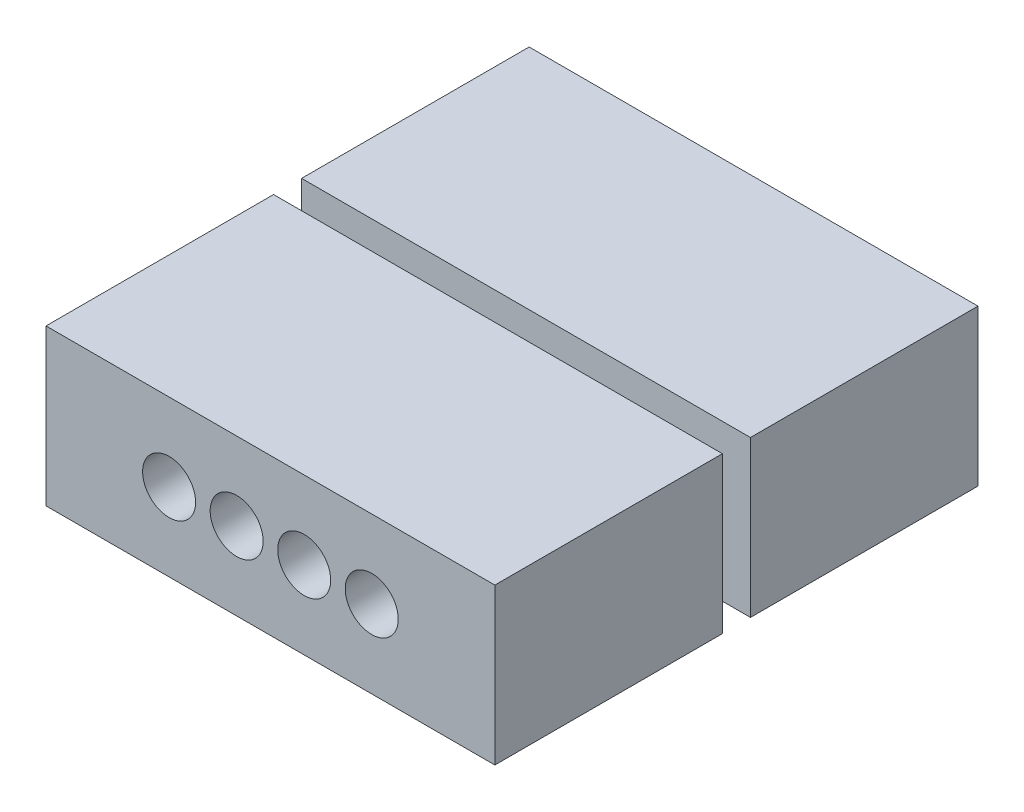
ISO-10303-21;
HEADER;
FILE_DESCRIPTION(('STEP AP214'),'2;1');
FILE_NAME('part.step','',(''),(''),'','','');
FILE_SCHEMA(('AUTOMOTIVE_DESIGN { 1 0 10303 214 1 1 1 1 }'));
ENDSEC;
DATA;
#1=APPLICATION_CONTEXT('core data for automotive mechanical design processes');
#2=APPLICATION_PROTOCOL_DEFINITION('international standard','automotive_design',2000,#1);
#3=PRODUCT_CONTEXT('',#1,'mechanical');
#4=PRODUCT('Part','Part','',(#3));
#5=PRODUCT_RELATED_PRODUCT_CATEGORY('part','',(#4));
#6=PRODUCT_DEFINITION_FORMATION('','',#4);
#7=PRODUCT_DEFINITION_CONTEXT('part definition',#1,'design');
#8=PRODUCT_DEFINITION('design','',#6,#7);
#9=PRODUCT_DEFINITION_SHAPE('','',#8);
#10=(LENGTH_UNIT() NAMED_UNIT(*) SI_UNIT(.MILLI.,.METRE.));
#11=(NAMED_UNIT(*) PLANE_ANGLE_UNIT() SI_UNIT($,.RADIAN.));
#12=(NAMED_UNIT(*) SI_UNIT($,.STERADIAN.) SOLID_ANGLE_UNIT());
#13=UNCERTAINTY_MEASURE_WITH_UNIT(LENGTH_MEASURE(1.E-05),#10,'distance_accuracy_value','');
#14=(GEOMETRIC_REPRESENTATION_CONTEXT(3) GLOBAL_UNCERTAINTY_ASSIGNED_CONTEXT((#13)) GLOBAL_UNIT_ASSIGNED_CONTEXT((#10,
#11,#12)) REPRESENTATION_CONTEXT('',''));
#15=CARTESIAN_POINT('',(0.,0.,0.));
#16=DIRECTION('',(0.,0.,1.));
#17=DIRECTION('',(1.,0.,0.));
#18=AXIS2_PLACEMENT_3D('',#15,#16,#17);
#19=CARTESIAN_POINT('',(0.,5.,0.));
#20=DIRECTION('',(0.,-1.,0.));
#21=DIRECTION('',(0.,0.,-1.));
#22=AXIS2_PLACEMENT_3D('',#19,#20,#21);
#23=PLANE('',#22);
#24=DIRECTION('',(1.,0.,0.));
#25=VECTOR('',#24,1.);
#26=CARTESIAN_POINT('',(-7.2,5.,-0.450000000000001));
#27=LINE('',#26,#25);
#28=CARTESIAN_POINT('',(-7.2,5.,-0.450000000000001));
#29=VERTEX_POINT('',#28);
#30=CARTESIAN_POINT('',(7.2,5.,-0.450000000000001));
#31=VERTEX_POINT('',#30);
#32=EDGE_CURVE('E58',#29,#31,#27,.T.);
#33=ORIENTED_EDGE('',*,*,#32,.T.);
#34=DIRECTION('',(0.,0.,-1.));
#35=VECTOR('',#34,1.);
#36=CARTESIAN_POINT('',(7.2,5.,-0.450000000000001));
#37=LINE('',#36,#35);
#38=CARTESIAN_POINT('',(7.2,5.,-7.75));
#39=VERTEX_POINT('',#38);
#40=EDGE_CURVE('E184',#31,#39,#37,.T.);
#41=ORIENTED_EDGE('',*,*,#40,.T.);
#42=DIRECTION('',(-1.,0.,0.));
#43=VECTOR('',#42,1.);
#44=CARTESIAN_POINT('',(-7.2,5.,-7.75));
#45=LINE('',#44,#43);
#46=CARTESIAN_POINT('',(-7.2,5.,-7.75));
#47=VERTEX_POINT('',#46);
#48=EDGE_CURVE('E111',#39,#47,#45,.T.);
#49=ORIENTED_EDGE('',*,*,#48,.T.);
#50=DIRECTION('',(0.,0.,1.));
#51=VECTOR('',#50,1.);
#52=CARTESIAN_POINT('',(-7.2,5.,-0.450000000000001));
#53=LINE('',#52,#51);
#54=EDGE_CURVE('E206',#47,#29,#53,.T.);
#55=ORIENTED_EDGE('',*,*,#54,.T.);
#56=EDGE_LOOP('',(#33,#41,#49,#55));
#57=FACE_BOUND('',#56,.T.);
#58=ADVANCED_FACE('F34',(#57),#23,.F.);
#59=CARTESIAN_POINT('',(7.2,5.,-0.450000000000001));
#60=DIRECTION('',(-1.,0.,0.));
#61=DIRECTION('',(0.,0.,1.));
#62=AXIS2_PLACEMENT_3D('',#59,#60,#61);
#63=PLANE('',#62);
#64=DIRECTION('',(0.,0.,-1.));
#65=VECTOR('',#64,1.);
#66=CARTESIAN_POINT('',(7.2,0.,-0.450000000000001));
#67=LINE('',#66,#65);
#68=CARTESIAN_POINT('',(7.2,0.,-0.450000000000001));
#69=VERTEX_POINT('',#68);
#70=CARTESIAN_POINT('',(7.2,0.,-7.75));
#71=VERTEX_POINT('',#70);
#72=EDGE_CURVE('E157',#69,#71,#67,.T.);
#73=ORIENTED_EDGE('',*,*,#72,.T.);
#74=DIRECTION('',(0.,-1.,0.));
#75=VECTOR('',#74,1.);
#76=CARTESIAN_POINT('',(7.2,5.,-7.75));
#77=LINE('',#76,#75);
#78=EDGE_CURVE('E11',#39,#71,#77,.T.);
#79=ORIENTED_EDGE('',*,*,#78,.F.);
#80=ORIENTED_EDGE('',*,*,#40,.F.);
#81=DIRECTION('',(0.,-1.,0.));
#82=VECTOR('',#81,1.);
#83=CARTESIAN_POINT('',(7.2,5.,-0.450000000000001));
#84=LINE('',#83,#82);
#85=EDGE_CURVE('E151',#31,#69,#84,.T.);
#86=ORIENTED_EDGE('',*,*,#85,.T.);
#87=EDGE_LOOP('',(#73,#79,#80,#86));
#88=FACE_BOUND('',#87,.T.);
#89=ADVANCED_FACE('F36',(#88),#63,.F.);
#90=CARTESIAN_POINT('',(-7.2,5.,-7.75));
#91=DIRECTION('',(0.,0.,1.));
#92=DIRECTION('',(1.,0.,0.));
#93=AXIS2_PLACEMENT_3D('',#90,#91,#92);
#94=PLANE('',#93);
#95=DIRECTION('',(-1.,0.,0.));
#96=VECTOR('',#95,1.);
#97=CARTESIAN_POINT('',(4.7,2.,-7.75));
#98=LINE('',#97,#96);
#99=CARTESIAN_POINT('',(4.7,2.,-7.75));
#100=VERTEX_POINT('',#99);
#101=CARTESIAN_POINT('',(-4.7,2.,-7.75));
#102=VERTEX_POINT('',#101);
#103=EDGE_CURVE('E277',#100,#102,#98,.T.);
#104=ORIENTED_EDGE('',*,*,#103,.F.);
#105=DIRECTION('',(0.,-1.,0.));
#106=VECTOR('',#105,1.);
#107=CARTESIAN_POINT('',(4.7,3.2,-7.75));
#108=LINE('',#107,#106);
#109=CARTESIAN_POINT('',(4.7,3.2,-7.75));
#110=VERTEX_POINT('',#109);
#111=EDGE_CURVE('E49',#110,#100,#108,.T.);
#112=ORIENTED_EDGE('',*,*,#111,.F.);
#113=DIRECTION('',(-1.,0.,0.));
#114=VECTOR('',#113,1.);
#115=CARTESIAN_POINT('',(4.7,3.2,-7.75));
#116=LINE('',#115,#114);
#117=CARTESIAN_POINT('',(-4.7,3.2,-7.75));
#118=VERTEX_POINT('',#117);
#119=EDGE_CURVE('E270',#110,#118,#116,.T.);
#120=ORIENTED_EDGE('',*,*,#119,.T.);
#121=DIRECTION('',(0.,-1.,0.));
#122=VECTOR('',#121,1.);
#123=CARTESIAN_POINT('',(-4.7,3.2,-7.75));
#124=LINE('',#123,#122);
#125=EDGE_CURVE('E274',#118,#102,#124,.T.);
#126=ORIENTED_EDGE('',*,*,#125,.T.);
#127=EDGE_LOOP('',(#104,#112,#120,#126));
#128=FACE_BOUND('',#127,.T.);
#129=DIRECTION('',(-1.,0.,0.));
#130=VECTOR('',#129,1.);
#131=CARTESIAN_POINT('',(-7.2,0.,-7.75));
#132=LINE('',#131,#130);
#133=CARTESIAN_POINT('',(-7.2,0.,-7.75));
#134=VERTEX_POINT('',#133);
#135=EDGE_CURVE('E160',#71,#134,#132,.T.);
#136=ORIENTED_EDGE('',*,*,#135,.T.);
#137=DIRECTION('',(0.,-1.,0.));
#138=VECTOR('',#137,1.);
#139=CARTESIAN_POINT('',(-7.2,5.,-7.75));
#140=LINE('',#139,#138);
#141=EDGE_CURVE('E42',#47,#134,#140,.T.);
#142=ORIENTED_EDGE('',*,*,#141,.F.);
#143=ORIENTED_EDGE('',*,*,#48,.F.);
#144=ORIENTED_EDGE('',*,*,#78,.T.);
#145=EDGE_LOOP('',(#136,#142,#143,#144));
#146=FACE_BOUND('',#145,.T.);
#147=ADVANCED_FACE('F343',(#128,#146),#94,.F.);
#148=CARTESIAN_POINT('',(-7.2,5.,-0.450000000000001));
#149=DIRECTION('',(1.,0.,0.));
#150=DIRECTION('',(0.,0.,-1.));
#151=AXIS2_PLACEMENT_3D('',#148,#149,#150);
#152=PLANE('',#151);
#153=DIRECTION('',(0.,0.,1.));
#154=VECTOR('',#153,1.);
#155=CARTESIAN_POINT('',(-7.2,0.,-0.450000000000001));
#156=LINE('',#155,#154);
#157=CARTESIAN_POINT('',(-7.2,0.,-0.450000000000001));
#158=VERTEX_POINT('',#157);
#159=EDGE_CURVE('E163',#134,#158,#156,.T.);
#160=ORIENTED_EDGE('',*,*,#159,.T.);
#161=DIRECTION('',(0.,-1.,0.));
#162=VECTOR('',#161,1.);
#163=CARTESIAN_POINT('',(-7.2,5.,-0.450000000000001));
#164=LINE('',#163,#162);
#165=EDGE_CURVE('E198',#29,#158,#164,.T.);
#166=ORIENTED_EDGE('',*,*,#165,.F.);
#167=ORIENTED_EDGE('',*,*,#54,.F.);
#168=ORIENTED_EDGE('',*,*,#141,.T.);
#169=EDGE_LOOP('',(#160,#166,#167,#168));
#170=FACE_BOUND('',#169,.T.);
#171=ADVANCED_FACE('F204',(#170),#152,.F.);
#172=CARTESIAN_POINT('',(-6.2,5.,-0.450000000000001));
#173=DIRECTION('',(1.,0.,0.));
#174=DIRECTION('',(0.,0.,-1.));
#175=AXIS2_PLACEMENT_3D('',#172,#173,#174);
#176=PLANE('',#175);
#177=DIRECTION('',(0.,-1.,0.));
#178=VECTOR('',#177,1.);
#179=CARTESIAN_POINT('',(-6.2,5.,0.449999999999999));
#180=LINE('',#179,#178);
#181=CARTESIAN_POINT('',(-6.2,3.5,0.449999999999999));
#182=VERTEX_POINT('',#181);
#183=CARTESIAN_POINT('',(-6.2,0.,0.449999999999999));
#184=VERTEX_POINT('',#183);
#185=EDGE_CURVE('E194',#182,#184,#180,.T.);
#186=ORIENTED_EDGE('',*,*,#185,.F.);
#187=DIRECTION('',(0.,0.,1.));
#188=VECTOR('',#187,1.);
#189=CARTESIAN_POINT('',(-6.2,3.5,0.449999999999999));
#190=LINE('',#189,#188);
#191=CARTESIAN_POINT('',(-6.2,3.5,-0.450000000000001));
#192=VERTEX_POINT('',#191);
#193=EDGE_CURVE('E232',#192,#182,#190,.T.);
#194=ORIENTED_EDGE('',*,*,#193,.F.);
#195=DIRECTION('',(0.,-1.,0.));
#196=VECTOR('',#195,1.);
#197=CARTESIAN_POINT('',(-6.2,5.,-0.450000000000001));
#198=LINE('',#197,#196);
#199=CARTESIAN_POINT('',(-6.2,0.,-0.450000000000001));
#200=VERTEX_POINT('',#199);
#201=EDGE_CURVE('E196',#192,#200,#198,.T.);
#202=ORIENTED_EDGE('',*,*,#201,.T.);
#203=DIRECTION('',(0.,0.,1.));
#204=VECTOR('',#203,1.);
#205=CARTESIAN_POINT('',(-6.2,0.,-0.450000000000001));
#206=LINE('',#205,#204);
#207=EDGE_CURVE('E168',#200,#184,#206,.T.);
#208=ORIENTED_EDGE('',*,*,#207,.T.);
#209=EDGE_LOOP('',(#186,#194,#202,#208));
#210=FACE_BOUND('',#209,.T.);
#211=ADVANCED_FACE('F327',(#210),#176,.F.);
#212=CARTESIAN_POINT('',(-7.2,5.,7.75));
#213=DIRECTION('',(1.,0.,0.));
#214=DIRECTION('',(0.,0.,-1.));
#215=AXIS2_PLACEMENT_3D('',#212,#213,#214);
#216=PLANE('',#215);
#217=DIRECTION('',(0.,0.,1.));
#218=VECTOR('',#217,1.);
#219=CARTESIAN_POINT('',(-7.2,0.,7.75));
#220=LINE('',#219,#218);
#221=CARTESIAN_POINT('',(-7.2,0.,0.449999999999999));
#222=VERTEX_POINT('',#221);
#223=CARTESIAN_POINT('',(-7.2,0.,7.75));
#224=VERTEX_POINT('',#223);
#225=EDGE_CURVE('E173',#222,#224,#220,.T.);
#226=ORIENTED_EDGE('',*,*,#225,.T.);
#227=DIRECTION('',(0.,-1.,0.));
#228=VECTOR('',#227,1.);
#229=CARTESIAN_POINT('',(-7.2,5.,7.75));
#230=LINE('',#229,#228);
#231=CARTESIAN_POINT('',(-7.2,5.,7.75));
#232=VERTEX_POINT('',#231);
#233=EDGE_CURVE('E146',#232,#224,#230,.T.);
#234=ORIENTED_EDGE('',*,*,#233,.F.);
#235=DIRECTION('',(0.,0.,1.));
#236=VECTOR('',#235,1.);
#237=CARTESIAN_POINT('',(-7.2,5.,7.75));
#238=LINE('',#237,#236);
#239=CARTESIAN_POINT('',(-7.2,5.,0.449999999999999));
#240=VERTEX_POINT('',#239);
#241=EDGE_CURVE('E134',#240,#232,#238,.T.);
#242=ORIENTED_EDGE('',*,*,#241,.F.);
#243=DIRECTION('',(0.,-1.,0.));
#244=VECTOR('',#243,1.);
#245=CARTESIAN_POINT('',(-7.2,5.,0.449999999999999));
#246=LINE('',#245,#244);
#247=EDGE_CURVE('E191',#240,#222,#246,.T.);
#248=ORIENTED_EDGE('',*,*,#247,.T.);
#249=EDGE_LOOP('',(#226,#234,#242,#248));
#250=FACE_BOUND('',#249,.T.);
#251=ADVANCED_FACE('F363',(#250),#216,.F.);
#252=CARTESIAN_POINT('',(-7.2,5.,7.75));
#253=DIRECTION('',(0.,0.,-1.));
#254=DIRECTION('',(-1.,0.,0.));
#255=AXIS2_PLACEMENT_3D('',#252,#253,#254);
#256=PLANE('',#255);
#257=CARTESIAN_POINT('',(3.25,2.5,7.75));
#258=DIRECTION('',(0.,0.,1.));
#259=DIRECTION('',(1.,0.,0.));
#260=AXIS2_PLACEMENT_3D('',#257,#258,#259);
#261=CIRCLE('',#260,0.849999999999999);
#262=CARTESIAN_POINT('',(4.1,2.5,7.75));
#263=VERTEX_POINT('',#262);
#264=EDGE_CURVE('E254',#263,#263,#261,.T.);
#265=ORIENTED_EDGE('',*,*,#264,.F.);
#266=EDGE_LOOP('',(#265));
#267=FACE_BOUND('',#266,.T.);
#268=CARTESIAN_POINT('',(1.08333333333333,2.5,7.75));
#269=DIRECTION('',(0.,0.,1.));
#270=DIRECTION('',(1.,0.,0.));
#271=AXIS2_PLACEMENT_3D('',#268,#269,#270);
#272=CIRCLE('',#271,0.85);
#273=CARTESIAN_POINT('',(1.93333333333333,2.5,7.75));
#274=VERTEX_POINT('',#273);
#275=EDGE_CURVE('E248',#274,#274,#272,.T.);
#276=ORIENTED_EDGE('',*,*,#275,.F.);
#277=EDGE_LOOP('',(#276));
#278=FACE_BOUND('',#277,.T.);
#279=CARTESIAN_POINT('',(-3.25,2.5,7.75));
#280=DIRECTION('',(0.,0.,1.));
#281=DIRECTION('',(1.,0.,0.));
#282=AXIS2_PLACEMENT_3D('',#279,#280,#281);
#283=CIRCLE('',#282,0.85);
#284=CARTESIAN_POINT('',(-2.4,2.5,7.75));
#285=VERTEX_POINT('',#284);
#286=EDGE_CURVE('E242',#285,#285,#283,.T.);
#287=ORIENTED_EDGE('',*,*,#286,.F.);
#288=EDGE_LOOP('',(#287));
#289=FACE_BOUND('',#288,.T.);
#290=CARTESIAN_POINT('',(-1.08333333333333,2.5,7.75));
#291=DIRECTION('',(0.,0.,1.));
#292=DIRECTION('',(1.,0.,0.));
#293=AXIS2_PLACEMENT_3D('',#290,#291,#292);
#294=CIRCLE('',#293,0.85);
#295=CARTESIAN_POINT('',(-0.233333333333333,2.5,7.75));
#296=VERTEX_POINT('',#295);
#297=EDGE_CURVE('E236',#296,#296,#294,.T.);
#298=ORIENTED_EDGE('',*,*,#297,.F.);
#299=EDGE_LOOP('',(#298));
#300=FACE_BOUND('',#299,.T.);
#301=DIRECTION('',(1.,0.,0.));
#302=VECTOR('',#301,1.);
#303=CARTESIAN_POINT('',(-7.2,0.,7.75));
#304=LINE('',#303,#302);
#305=CARTESIAN_POINT('',(7.2,0.,7.75));
#306=VERTEX_POINT('',#305);
#307=EDGE_CURVE('E143',#224,#306,#304,.T.);
#308=ORIENTED_EDGE('',*,*,#307,.T.);
#309=DIRECTION('',(0.,-1.,0.));
#310=VECTOR('',#309,1.);
#311=CARTESIAN_POINT('',(7.2,5.,7.75));
#312=LINE('',#311,#310);
#313=CARTESIAN_POINT('',(7.2,5.,7.75));
#314=VERTEX_POINT('',#313);
#315=EDGE_CURVE('E140',#314,#306,#312,.T.);
#316=ORIENTED_EDGE('',*,*,#315,.F.);
#317=DIRECTION('',(1.,0.,0.));
#318=VECTOR('',#317,1.);
#319=CARTESIAN_POINT('',(-7.2,5.,7.75));
#320=LINE('',#319,#318);
#321=EDGE_CURVE('E127',#232,#314,#320,.T.);
#322=ORIENTED_EDGE('',*,*,#321,.F.);
#323=ORIENTED_EDGE('',*,*,#233,.T.);
#324=EDGE_LOOP('',(#308,#316,#322,#323));
#325=FACE_BOUND('',#324,.T.);
#326=ADVANCED_FACE('F141',(#267,#278,#289,#300,#325),#256,.F.);
#327=CARTESIAN_POINT('',(7.2,5.,7.75));
#328=DIRECTION('',(-1.,0.,0.));
#329=DIRECTION('',(0.,0.,1.));
#330=AXIS2_PLACEMENT_3D('',#327,#328,#329);
#331=PLANE('',#330);
#332=DIRECTION('',(0.,0.,-1.));
#333=VECTOR('',#332,1.);
#334=CARTESIAN_POINT('',(7.2,0.,7.75));
#335=LINE('',#334,#333);
#336=CARTESIAN_POINT('',(7.2,0.,0.449999999999999));
#337=VERTEX_POINT('',#336);
#338=EDGE_CURVE('E176',#306,#337,#335,.T.);
#339=ORIENTED_EDGE('',*,*,#338,.T.);
#340=DIRECTION('',(0.,-1.,0.));
#341=VECTOR('',#340,1.);
#342=CARTESIAN_POINT('',(7.2,5.,0.449999999999999));
#343=LINE('',#342,#341);
#344=CARTESIAN_POINT('',(7.2,5.,0.449999999999999));
#345=VERTEX_POINT('',#344);
#346=EDGE_CURVE('E147',#345,#337,#343,.T.);
#347=ORIENTED_EDGE('',*,*,#346,.F.);
#348=DIRECTION('',(0.,0.,-1.));
#349=VECTOR('',#348,1.);
#350=CARTESIAN_POINT('',(7.2,5.,7.75));
#351=LINE('',#350,#349);
#352=EDGE_CURVE('E131',#314,#345,#351,.T.);
#353=ORIENTED_EDGE('',*,*,#352,.F.);
#354=ORIENTED_EDGE('',*,*,#315,.T.);
#355=EDGE_LOOP('',(#339,#347,#353,#354));
#356=FACE_BOUND('',#355,.T.);
#357=ADVANCED_FACE('F149',(#356),#331,.F.);
#358=CARTESIAN_POINT('',(7.2,5.,0.449999999999999));
#359=DIRECTION('',(0.,0.,1.));
#360=DIRECTION('',(1.,0.,0.));
#361=AXIS2_PLACEMENT_3D('',#358,#359,#360);
#362=PLANE('',#361);
#363=DIRECTION('',(-1.,0.,0.));
#364=VECTOR('',#363,1.);
#365=CARTESIAN_POINT('',(7.2,0.,0.449999999999999));
#366=LINE('',#365,#364);
#367=CARTESIAN_POINT('',(6.2,0.,0.449999999999999));
#368=VERTEX_POINT('',#367);
#369=EDGE_CURVE('E178',#337,#368,#366,.T.);
#370=ORIENTED_EDGE('',*,*,#369,.T.);
#371=DIRECTION('',(0.,-1.,0.));
#372=VECTOR('',#371,1.);
#373=CARTESIAN_POINT('',(6.2,5.,0.449999999999999));
#374=LINE('',#373,#372);
#375=CARTESIAN_POINT('',(6.2,3.5,0.449999999999999));
#376=VERTEX_POINT('',#375);
#377=EDGE_CURVE('E187',#376,#368,#374,.T.);
#378=ORIENTED_EDGE('',*,*,#377,.F.);
#379=DIRECTION('',(1.,0.,0.));
#380=VECTOR('',#379,1.);
#381=CARTESIAN_POINT('',(-6.2,3.5,0.449999999999999));
#382=LINE('',#381,#380);
#383=EDGE_CURVE('E229',#182,#376,#382,.T.);
#384=ORIENTED_EDGE('',*,*,#383,.F.);
#385=ORIENTED_EDGE('',*,*,#185,.T.);
#386=DIRECTION('',(-1.,0.,0.));
#387=VECTOR('',#386,1.);
#388=CARTESIAN_POINT('',(-7.2,0.,0.449999999999999));
#389=LINE('',#388,#387);
#390=EDGE_CURVE('E171',#184,#222,#389,.T.);
#391=ORIENTED_EDGE('',*,*,#390,.T.);
#392=ORIENTED_EDGE('',*,*,#247,.F.);
#393=DIRECTION('',(-1.,0.,0.));
#394=VECTOR('',#393,1.);
#395=CARTESIAN_POINT('',(-7.2,5.,0.449999999999999));
#396=LINE('',#395,#394);
#397=EDGE_CURVE('E217',#345,#240,#396,.T.);
#398=ORIENTED_EDGE('',*,*,#397,.F.);
#399=ORIENTED_EDGE('',*,*,#346,.T.);
#400=EDGE_LOOP('',(#370,#378,#384,#385,#391,#392,#398,#399));
#401=FACE_BOUND('',#400,.T.);
#402=ADVANCED_FACE('F329',(#401),#362,.F.);
#403=CARTESIAN_POINT('',(6.2,5.,-0.450000000000001));
#404=DIRECTION('',(-1.,0.,0.));
#405=DIRECTION('',(0.,0.,1.));
#406=AXIS2_PLACEMENT_3D('',#403,#404,#405);
#407=PLANE('',#406);
#408=DIRECTION('',(0.,-1.,0.));
#409=VECTOR('',#408,1.);
#410=CARTESIAN_POINT('',(6.2,5.,-0.450000000000001));
#411=LINE('',#410,#409);
#412=CARTESIAN_POINT('',(6.2,3.5,-0.450000000000001));
#413=VERTEX_POINT('',#412);
#414=CARTESIAN_POINT('',(6.2,0.,-0.450000000000001));
#415=VERTEX_POINT('',#414);
#416=EDGE_CURVE('E153',#413,#415,#411,.T.);
#417=ORIENTED_EDGE('',*,*,#416,.F.);
#418=DIRECTION('',(0.,0.,-1.));
#419=VECTOR('',#418,1.);
#420=CARTESIAN_POINT('',(6.2,3.5,0.449999999999999));
#421=LINE('',#420,#419);
#422=EDGE_CURVE('E226',#376,#413,#421,.T.);
#423=ORIENTED_EDGE('',*,*,#422,.F.);
#424=ORIENTED_EDGE('',*,*,#377,.T.);
#425=DIRECTION('',(0.,0.,-1.));
#426=VECTOR('',#425,1.);
#427=CARTESIAN_POINT('',(6.2,0.,-0.450000000000001));
#428=LINE('',#427,#426);
#429=EDGE_CURVE('E181',#368,#415,#428,.T.);
#430=ORIENTED_EDGE('',*,*,#429,.T.);
#431=EDGE_LOOP('',(#417,#423,#424,#430));
#432=FACE_BOUND('',#431,.T.);
#433=ADVANCED_FACE('F333',(#432),#407,.F.);
#434=CARTESIAN_POINT('',(7.2,5.,-0.450000000000001));
#435=DIRECTION('',(0.,0.,-1.));
#436=DIRECTION('',(-1.,0.,0.));
#437=AXIS2_PLACEMENT_3D('',#434,#435,#436);
#438=PLANE('',#437);
#439=DIRECTION('',(1.,0.,0.));
#440=VECTOR('',#439,1.);
#441=CARTESIAN_POINT('',(7.2,0.,-0.450000000000001));
#442=LINE('',#441,#440);
#443=EDGE_CURVE('E103',#415,#69,#442,.T.);
#444=ORIENTED_EDGE('',*,*,#443,.T.);
#445=ORIENTED_EDGE('',*,*,#85,.F.);
#446=ORIENTED_EDGE('',*,*,#32,.F.);
#447=ORIENTED_EDGE('',*,*,#165,.T.);
#448=DIRECTION('',(1.,0.,0.));
#449=VECTOR('',#448,1.);
#450=CARTESIAN_POINT('',(-7.2,0.,-0.450000000000001));
#451=LINE('',#450,#449);
#452=EDGE_CURVE('E165',#158,#200,#451,.T.);
#453=ORIENTED_EDGE('',*,*,#452,.T.);
#454=ORIENTED_EDGE('',*,*,#201,.F.);
#455=DIRECTION('',(-1.,0.,0.));
#456=VECTOR('',#455,1.);
#457=CARTESIAN_POINT('',(-6.2,3.5,-0.450000000000001));
#458=LINE('',#457,#456);
#459=EDGE_CURVE('E161',#413,#192,#458,.T.);
#460=ORIENTED_EDGE('',*,*,#459,.F.);
#461=ORIENTED_EDGE('',*,*,#416,.T.);
#462=EDGE_LOOP('',(#444,#445,#446,#447,#453,#454,#460,#461));
#463=FACE_BOUND('',#462,.T.);
#464=ADVANCED_FACE('F214',(#463),#438,.F.);
#465=ORIENTED_EDGE('',*,*,#352,.T.);
#466=ORIENTED_EDGE('',*,*,#397,.T.);
#467=ORIENTED_EDGE('',*,*,#241,.T.);
#468=ORIENTED_EDGE('',*,*,#321,.T.);
#469=EDGE_LOOP('',(#465,#466,#467,#468));
#470=FACE_BOUND('',#469,.T.);
#471=ADVANCED_FACE('F129',(#470),#23,.F.);
#472=CARTESIAN_POINT('',(0.,0.,0.));
#473=DIRECTION('',(0.,-1.,0.));
#474=DIRECTION('',(0.,0.,-1.));
#475=AXIS2_PLACEMENT_3D('',#472,#473,#474);
#476=PLANE('',#475);
#477=ORIENTED_EDGE('',*,*,#72,.F.);
#478=ORIENTED_EDGE('',*,*,#443,.F.);
#479=ORIENTED_EDGE('',*,*,#429,.F.);
#480=ORIENTED_EDGE('',*,*,#369,.F.);
#481=ORIENTED_EDGE('',*,*,#338,.F.);
#482=ORIENTED_EDGE('',*,*,#307,.F.);
#483=ORIENTED_EDGE('',*,*,#225,.F.);
#484=ORIENTED_EDGE('',*,*,#390,.F.);
#485=ORIENTED_EDGE('',*,*,#207,.F.);
#486=ORIENTED_EDGE('',*,*,#452,.F.);
#487=ORIENTED_EDGE('',*,*,#159,.F.);
#488=ORIENTED_EDGE('',*,*,#135,.F.);
#489=EDGE_LOOP('',(#477,#478,#479,#480,#481,#482,#483,#484,#485,#486,#487,#488));
#490=FACE_BOUND('',#489,.T.);
#491=ADVANCED_FACE('F210',(#490),#476,.T.);
#492=CARTESIAN_POINT('',(0.,3.5,0.));
#493=DIRECTION('',(0.,-1.,0.));
#494=DIRECTION('',(0.,0.,-1.));
#495=AXIS2_PLACEMENT_3D('',#492,#493,#494);
#496=PLANE('',#495);
#497=ORIENTED_EDGE('',*,*,#193,.T.);
#498=ORIENTED_EDGE('',*,*,#383,.T.);
#499=ORIENTED_EDGE('',*,*,#422,.T.);
#500=ORIENTED_EDGE('',*,*,#459,.T.);
#501=EDGE_LOOP('',(#497,#498,#499,#500));
#502=FACE_BOUND('',#501,.T.);
#503=ADVANCED_FACE('F323',(#502),#496,.F.);
#504=CARTESIAN_POINT('',(-1.08333333333333,2.5,4.75));
#505=DIRECTION('',(0.,0.,1.));
#506=DIRECTION('',(1.,0.,0.));
#507=AXIS2_PLACEMENT_3D('',#504,#505,#506);
#508=CYLINDRICAL_SURFACE('',#507,0.85);
#509=CARTESIAN_POINT('',(-1.08333333333333,2.5,4.75));
#510=DIRECTION('',(0.,0.,1.));
#511=DIRECTION('',(1.,0.,0.));
#512=AXIS2_PLACEMENT_3D('',#509,#510,#511);
#513=CIRCLE('',#512,0.85);
#514=CARTESIAN_POINT('',(-0.233333333333333,2.5,4.75));
#515=VERTEX_POINT('',#514);
#516=EDGE_CURVE('E235',#515,#515,#513,.T.);
#517=ORIENTED_EDGE('',*,*,#516,.F.);
#518=EDGE_LOOP('',(#517));
#519=FACE_BOUND('',#518,.T.);
#520=ORIENTED_EDGE('',*,*,#297,.T.);
#521=EDGE_LOOP('',(#520));
#522=FACE_BOUND('',#521,.T.);
#523=ADVANCED_FACE('F423',(#519,#522),#508,.F.);
#524=CARTESIAN_POINT('',(-1.08333333333333,2.5,4.75));
#525=DIRECTION('',(0.,0.,1.));
#526=DIRECTION('',(1.,0.,0.));
#527=AXIS2_PLACEMENT_3D('',#524,#525,#526);
#528=PLANE('',#527);
#529=ORIENTED_EDGE('',*,*,#516,.T.);
#530=EDGE_LOOP('',(#529));
#531=FACE_BOUND('',#530,.T.);
#532=ADVANCED_FACE('F419',(#531),#528,.T.);
#533=CARTESIAN_POINT('',(-3.25,2.5,4.75));
#534=DIRECTION('',(0.,0.,1.));
#535=DIRECTION('',(1.,0.,0.));
#536=AXIS2_PLACEMENT_3D('',#533,#534,#535);
#537=CYLINDRICAL_SURFACE('',#536,0.85);
#538=CARTESIAN_POINT('',(-3.25,2.5,4.75));
#539=DIRECTION('',(0.,0.,1.));
#540=DIRECTION('',(1.,0.,0.));
#541=AXIS2_PLACEMENT_3D('',#538,#539,#540);
#542=CIRCLE('',#541,0.85);
#543=CARTESIAN_POINT('',(-2.4,2.5,4.75));
#544=VERTEX_POINT('',#543);
#545=EDGE_CURVE('E239',#544,#544,#542,.T.);
#546=ORIENTED_EDGE('',*,*,#545,.F.);
#547=EDGE_LOOP('',(#546));
#548=FACE_BOUND('',#547,.T.);
#549=ORIENTED_EDGE('',*,*,#286,.T.);
#550=EDGE_LOOP('',(#549));
#551=FACE_BOUND('',#550,.T.);
#552=ADVANCED_FACE('F415',(#548,#551),#537,.F.);
#553=CARTESIAN_POINT('',(-3.25,2.5,4.75));
#554=DIRECTION('',(0.,0.,1.));
#555=DIRECTION('',(1.,0.,0.));
#556=AXIS2_PLACEMENT_3D('',#553,#554,#555);
#557=PLANE('',#556);
#558=ORIENTED_EDGE('',*,*,#545,.T.);
#559=EDGE_LOOP('',(#558));
#560=FACE_BOUND('',#559,.T.);
#561=ADVANCED_FACE('F411',(#560),#557,.T.);
#562=CARTESIAN_POINT('',(1.08333333333333,2.5,4.75));
#563=DIRECTION('',(0.,0.,1.));
#564=DIRECTION('',(1.,0.,0.));
#565=AXIS2_PLACEMENT_3D('',#562,#563,#564);
#566=CYLINDRICAL_SURFACE('',#565,0.85);
#567=CARTESIAN_POINT('',(1.08333333333333,2.5,4.75));
#568=DIRECTION('',(0.,0.,1.));
#569=DIRECTION('',(1.,0.,0.));
#570=AXIS2_PLACEMENT_3D('',#567,#568,#569);
#571=CIRCLE('',#570,0.85);
#572=CARTESIAN_POINT('',(1.93333333333333,2.5,4.75));
#573=VERTEX_POINT('',#572);
#574=EDGE_CURVE('E245',#573,#573,#571,.T.);
#575=ORIENTED_EDGE('',*,*,#574,.F.);
#576=EDGE_LOOP('',(#575));
#577=FACE_BOUND('',#576,.T.);
#578=ORIENTED_EDGE('',*,*,#275,.T.);
#579=EDGE_LOOP('',(#578));
#580=FACE_BOUND('',#579,.T.);
#581=ADVANCED_FACE('F407',(#577,#580),#566,.F.);
#582=CARTESIAN_POINT('',(1.08333333333333,2.5,4.75));
#583=DIRECTION('',(0.,0.,1.));
#584=DIRECTION('',(1.,0.,0.));
#585=AXIS2_PLACEMENT_3D('',#582,#583,#584);
#586=PLANE('',#585);
#587=ORIENTED_EDGE('',*,*,#574,.T.);
#588=EDGE_LOOP('',(#587));
#589=FACE_BOUND('',#588,.T.);
#590=ADVANCED_FACE('F403',(#589),#586,.T.);
#591=CARTESIAN_POINT('',(3.25,2.5,4.75));
#592=DIRECTION('',(0.,0.,1.));
#593=DIRECTION('',(1.,0.,0.));
#594=AXIS2_PLACEMENT_3D('',#591,#592,#593);
#595=CYLINDRICAL_SURFACE('',#594,0.849999999999999);
#596=CARTESIAN_POINT('',(3.25,2.5,4.75));
#597=DIRECTION('',(0.,0.,1.));
#598=DIRECTION('',(1.,0.,0.));
#599=AXIS2_PLACEMENT_3D('',#596,#597,#598);
#600=CIRCLE('',#599,0.849999999999999);
#601=CARTESIAN_POINT('',(4.1,2.5,4.75));
#602=VERTEX_POINT('',#601);
#603=EDGE_CURVE('E251',#602,#602,#600,.T.);
#604=ORIENTED_EDGE('',*,*,#603,.F.);
#605=EDGE_LOOP('',(#604));
#606=FACE_BOUND('',#605,.T.);
#607=ORIENTED_EDGE('',*,*,#264,.T.);
#608=EDGE_LOOP('',(#607));
#609=FACE_BOUND('',#608,.T.);
#610=ADVANCED_FACE('F399',(#606,#609),#595,.F.);
#611=CARTESIAN_POINT('',(3.25,2.5,4.75));
#612=DIRECTION('',(0.,0.,1.));
#613=DIRECTION('',(1.,0.,0.));
#614=AXIS2_PLACEMENT_3D('',#611,#612,#613);
#615=PLANE('',#614);
#616=ORIENTED_EDGE('',*,*,#603,.T.);
#617=EDGE_LOOP('',(#616));
#618=FACE_BOUND('',#617,.T.);
#619=ADVANCED_FACE('F391',(#618),#615,.T.);
#620=CARTESIAN_POINT('',(4.7,3.2,-0.25));
#621=DIRECTION('',(1.,0.,0.));
#622=DIRECTION('',(0.,0.,-1.));
#623=AXIS2_PLACEMENT_3D('',#620,#621,#622);
#624=PLANE('',#623);
#625=ORIENTED_EDGE('',*,*,#111,.T.);
#626=DIRECTION('',(0.,0.,-1.));
#627=VECTOR('',#626,1.);
#628=CARTESIAN_POINT('',(4.7,2.,-0.25));
#629=LINE('',#628,#627);
#630=CARTESIAN_POINT('',(4.7,2.,-0.25));
#631=VERTEX_POINT('',#630);
#632=EDGE_CURVE('E260',#631,#100,#629,.T.);
#633=ORIENTED_EDGE('',*,*,#632,.F.);
#634=DIRECTION('',(0.,-1.,0.));
#635=VECTOR('',#634,1.);
#636=CARTESIAN_POINT('',(4.7,3.2,-0.25));
#637=LINE('',#636,#635);
#638=CARTESIAN_POINT('',(4.7,3.2,-0.25));
#639=VERTEX_POINT('',#638);
#640=EDGE_CURVE('E273',#639,#631,#637,.T.);
#641=ORIENTED_EDGE('',*,*,#640,.F.);
#642=DIRECTION('',(0.,0.,-1.));
#643=VECTOR('',#642,1.);
#644=CARTESIAN_POINT('',(4.7,3.2,-0.25));
#645=LINE('',#644,#643);
#646=EDGE_CURVE('E257',#639,#110,#645,.T.);
#647=ORIENTED_EDGE('',*,*,#646,.T.);
#648=EDGE_LOOP('',(#625,#633,#641,#647));
#649=FACE_BOUND('',#648,.T.);
#650=ADVANCED_FACE('F301',(#649),#624,.F.);
#651=CARTESIAN_POINT('',(4.7,3.2,-0.25));
#652=DIRECTION('',(0.,-1.,0.));
#653=DIRECTION('',(0.,0.,-1.));
#654=AXIS2_PLACEMENT_3D('',#651,#652,#653);
#655=PLANE('',#654);
#656=ORIENTED_EDGE('',*,*,#119,.F.);
#657=ORIENTED_EDGE('',*,*,#646,.F.);
#658=DIRECTION('',(-1.,0.,0.));
#659=VECTOR('',#658,1.);
#660=CARTESIAN_POINT('',(4.7,3.2,-0.25));
#661=LINE('',#660,#659);
#662=CARTESIAN_POINT('',(-4.7,3.2,-0.25));
#663=VERTEX_POINT('',#662);
#664=EDGE_CURVE('E263',#639,#663,#661,.T.);
#665=ORIENTED_EDGE('',*,*,#664,.T.);
#666=DIRECTION('',(0.,0.,-1.));
#667=VECTOR('',#666,1.);
#668=CARTESIAN_POINT('',(-4.7,3.2,-0.25));
#669=LINE('',#668,#667);
#670=EDGE_CURVE('E266',#663,#118,#669,.T.);
#671=ORIENTED_EDGE('',*,*,#670,.T.);
#672=EDGE_LOOP('',(#656,#657,#665,#671));
#673=FACE_BOUND('',#672,.T.);
#674=ADVANCED_FACE('F383',(#673),#655,.T.);
#675=CARTESIAN_POINT('',(-4.7,3.2,-0.25));
#676=DIRECTION('',(1.,0.,0.));
#677=DIRECTION('',(0.,0.,-1.));
#678=AXIS2_PLACEMENT_3D('',#675,#676,#677);
#679=PLANE('',#678);
#680=ORIENTED_EDGE('',*,*,#125,.F.);
#681=ORIENTED_EDGE('',*,*,#670,.F.);
#682=DIRECTION('',(0.,-1.,0.));
#683=VECTOR('',#682,1.);
#684=CARTESIAN_POINT('',(-4.7,3.2,-0.25));
#685=LINE('',#684,#683);
#686=CARTESIAN_POINT('',(-4.7,2.,-0.25));
#687=VERTEX_POINT('',#686);
#688=EDGE_CURVE('E283',#663,#687,#685,.T.);
#689=ORIENTED_EDGE('',*,*,#688,.T.);
#690=DIRECTION('',(0.,0.,-1.));
#691=VECTOR('',#690,1.);
#692=CARTESIAN_POINT('',(-4.7,2.,-0.25));
#693=LINE('',#692,#691);
#694=EDGE_CURVE('E262',#687,#102,#693,.T.);
#695=ORIENTED_EDGE('',*,*,#694,.T.);
#696=EDGE_LOOP('',(#680,#681,#689,#695));
#697=FACE_BOUND('',#696,.T.);
#698=ADVANCED_FACE('F381',(#697),#679,.T.);
#699=CARTESIAN_POINT('',(4.7,2.,-0.25));
#700=DIRECTION('',(0.,-1.,0.));
#701=DIRECTION('',(0.,0.,-1.));
#702=AXIS2_PLACEMENT_3D('',#699,#700,#701);
#703=PLANE('',#702);
#704=ORIENTED_EDGE('',*,*,#103,.T.);
#705=ORIENTED_EDGE('',*,*,#694,.F.);
#706=DIRECTION('',(-1.,0.,0.));
#707=VECTOR('',#706,1.);
#708=CARTESIAN_POINT('',(4.7,2.,-0.25));
#709=LINE('',#708,#707);
#710=EDGE_CURVE('E286',#631,#687,#709,.T.);
#711=ORIENTED_EDGE('',*,*,#710,.F.);
#712=ORIENTED_EDGE('',*,*,#632,.T.);
#713=EDGE_LOOP('',(#704,#705,#711,#712));
#714=FACE_BOUND('',#713,.T.);
#715=ADVANCED_FACE('F379',(#714),#703,.F.);
#716=CARTESIAN_POINT('',(0.,0.,-0.25));
#717=DIRECTION('',(0.,0.,-1.));
#718=DIRECTION('',(-1.,0.,0.));
#719=AXIS2_PLACEMENT_3D('',#716,#717,#718);
#720=PLANE('',#719);
#721=ORIENTED_EDGE('',*,*,#640,.T.);
#722=ORIENTED_EDGE('',*,*,#710,.T.);
#723=ORIENTED_EDGE('',*,*,#688,.F.);
#724=ORIENTED_EDGE('',*,*,#664,.F.);
#725=EDGE_LOOP('',(#721,#722,#723,#724));
#726=FACE_BOUND('',#725,.T.);
#727=ADVANCED_FACE('F294',(#726),#720,.T.);
#728=CLOSED_SHELL('',(#58,#89,#147,#171,#211,#251,#326,#357,#402,#433,#464,#471,#491,#503,#523,
#532,#552,#561,#581,#590,#610,#619,#650,#674,#698,#715,#727));
#729=MANIFOLD_SOLID_BREP('B2',#728);
#730=ADVANCED_BREP_SHAPE_REPRESENTATION('',(#18,#729),#14);
#731=SHAPE_DEFINITION_REPRESENTATION(#9,#730);
ENDSEC;
END-ISO-10303-21;
